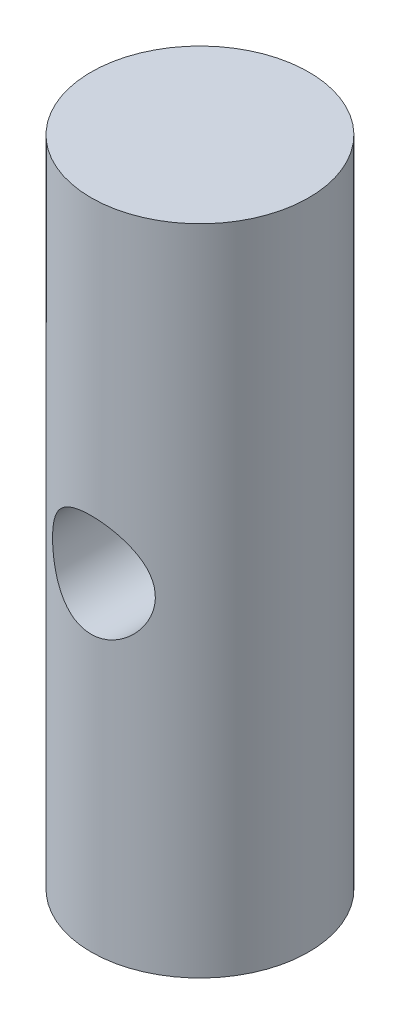
ISO-10303-21;
HEADER;
FILE_DESCRIPTION(('STEP AP214'),'2;1');
FILE_NAME('part.step','',(''),(''),'','','');
FILE_SCHEMA(('AUTOMOTIVE_DESIGN { 1 0 10303 214 1 1 1 1 }'));
ENDSEC;
DATA;
#1=APPLICATION_CONTEXT('core data for automotive mechanical design processes');
#2=APPLICATION_PROTOCOL_DEFINITION('international standard','automotive_design',2000,#1);
#3=PRODUCT_CONTEXT('',#1,'mechanical');
#4=PRODUCT('Part','Part','',(#3));
#5=PRODUCT_RELATED_PRODUCT_CATEGORY('part','',(#4));
#6=PRODUCT_DEFINITION_FORMATION('','',#4);
#7=PRODUCT_DEFINITION_CONTEXT('part definition',#1,'design');
#8=PRODUCT_DEFINITION('design','',#6,#7);
#9=PRODUCT_DEFINITION_SHAPE('','',#8);
#10=(LENGTH_UNIT() NAMED_UNIT(*) SI_UNIT(.MILLI.,.METRE.));
#11=(NAMED_UNIT(*) PLANE_ANGLE_UNIT() SI_UNIT($,.RADIAN.));
#12=(NAMED_UNIT(*) SI_UNIT($,.STERADIAN.) SOLID_ANGLE_UNIT());
#13=UNCERTAINTY_MEASURE_WITH_UNIT(LENGTH_MEASURE(1.E-05),#10,'distance_accuracy_value','');
#14=(GEOMETRIC_REPRESENTATION_CONTEXT(3) GLOBAL_UNCERTAINTY_ASSIGNED_CONTEXT((#13)) GLOBAL_UNIT_ASSIGNED_CONTEXT((#10,
#11,#12)) REPRESENTATION_CONTEXT('',''));
#15=CARTESIAN_POINT('',(0.,0.,0.));
#16=DIRECTION('',(0.,0.,1.));
#17=DIRECTION('',(1.,0.,0.));
#18=AXIS2_PLACEMENT_3D('',#15,#16,#17);
#19=CARTESIAN_POINT('',(0.,19.05,0.));
#20=DIRECTION('',(0.,-1.,0.));
#21=DIRECTION('',(0.,0.,-1.));
#22=AXIS2_PLACEMENT_3D('',#19,#20,#21);
#23=CYLINDRICAL_SURFACE('',#22,3.175);
#24=CARTESIAN_POINT('',(0.,19.05,0.));
#25=DIRECTION('',(0.,1.,0.));
#26=DIRECTION('',(0.,0.,1.));
#27=AXIS2_PLACEMENT_3D('',#24,#25,#26);
#28=CIRCLE('',#27,3.175);
#29=CARTESIAN_POINT('',(0.,19.05,3.175));
#30=VERTEX_POINT('',#29);
#31=EDGE_CURVE('E10',#30,#30,#28,.T.);
#32=ORIENTED_EDGE('',*,*,#31,.F.);
#33=EDGE_LOOP('',(#32));
#34=FACE_BOUND('',#33,.T.);
#35=CARTESIAN_POINT('',(0.,0.,0.));
#36=DIRECTION('',(0.,1.,0.));
#37=DIRECTION('',(0.,0.,1.));
#38=AXIS2_PLACEMENT_3D('',#35,#36,#37);
#39=CIRCLE('',#38,3.175);
#40=CARTESIAN_POINT('',(0.,0.,3.175));
#41=VERTEX_POINT('',#40);
#42=EDGE_CURVE('E46',#41,#41,#39,.T.);
#43=ORIENTED_EDGE('',*,*,#42,.T.);
#44=EDGE_LOOP('',(#43));
#45=FACE_BOUND('',#44,.T.);
#46=CARTESIAN_POINT('',(-1.4986,9.52500000000001,2.79907539019584));
#47=CARTESIAN_POINT('',(-1.49859525274599,9.44625277110889,2.79908094864217));
#48=CARTESIAN_POINT('',(-1.49235258129164,9.36739129426081,2.80244790388345));
#49=CARTESIAN_POINT('',(-1.46767606579195,9.21203633017721,2.81544586122155));
#50=CARTESIAN_POINT('',(-1.44921381278011,9.13554879690695,2.82509145949614));
#51=CARTESIAN_POINT('',(-1.40103604915084,8.98747563410045,2.84928743266656));
#52=CARTESIAN_POINT('',(-1.37137530680752,8.91586811844375,2.86381389931857));
#53=CARTESIAN_POINT('',(-1.30180847915593,8.77866285343059,2.89609829288426));
#54=CARTESIAN_POINT('',(-1.26190284575299,8.71306483916629,2.91385607725346));
#55=CARTESIAN_POINT('',(-1.16955327149753,8.58443409527947,2.95219309581897));
#56=CARTESIAN_POINT('',(-1.11640618581606,8.52193911852819,2.97288368175924));
#57=CARTESIAN_POINT('',(-1.00054973494847,8.40633859230654,3.01385145765495));
#58=CARTESIAN_POINT('',(-0.937836044662146,8.35323731333441,3.03412845590108));
#59=CARTESIAN_POINT('',(-0.800137369823889,8.25490300420467,3.07340492554687));
#60=CARTESIAN_POINT('',(-0.724649268859258,8.21031161482117,3.09226036654976));
#61=CARTESIAN_POINT('',(-0.56618781225491,8.13470271361576,3.12515385877692));
#62=CARTESIAN_POINT('',(-0.483218709957832,8.10367754665184,3.13919462585548));
#63=CARTESIAN_POINT('',(-0.317830558279715,8.05814643825242,3.16007921690025));
#64=CARTESIAN_POINT('',(-0.235721985413614,8.04270311504359,3.16732924544885));
#65=CARTESIAN_POINT('',(-0.0697822347022773,8.02570754014559,3.1753174564992));
#66=CARTESIAN_POINT('',(0.0140480043131758,8.02414790917636,3.17605909825132));
#67=CARTESIAN_POINT('',(0.174087776839426,8.03455579740571,3.17115640390632));
#68=CARTESIAN_POINT('',(0.250383327211232,8.04548166194073,3.16600378599288));
#69=CARTESIAN_POINT('',(0.399907930100079,8.07871432532521,3.15061091504814));
#70=CARTESIAN_POINT('',(0.473136754258764,8.10102197007409,3.14037028387471));
#71=CARTESIAN_POINT('',(0.615786299683944,8.15658554520967,3.11556672617083));
#72=CARTESIAN_POINT('',(0.68513467728847,8.18999852701138,3.10094211065064));
#73=CARTESIAN_POINT('',(0.817417883828342,8.266636160278,3.068728529374));
#74=CARTESIAN_POINT('',(0.880350351471504,8.30986440536888,3.05113847850263));
#75=CARTESIAN_POINT('',(1.00382158329375,8.40922436294251,3.01288863718608));
#76=CARTESIAN_POINT('',(1.06368128759606,8.46614924111113,2.99209492528907));
#77=CARTESIAN_POINT('',(1.1733475361455,8.5891302551537,2.95081699198232));
#78=CARTESIAN_POINT('',(1.22314779220729,8.65519205934713,2.93033297151652));
#79=CARTESIAN_POINT('',(1.31377670034922,8.79880046459922,2.89088002508329));
#80=CARTESIAN_POINT('',(1.35400720124191,8.87676465146671,2.87204449206278));
#81=CARTESIAN_POINT('',(1.42048070416232,9.03946961733449,2.83976055028701));
#82=CARTESIAN_POINT('',(1.44673685115611,9.1242039413921,2.82630708186621));
#83=CARTESIAN_POINT('',(1.48253180169813,9.29125823583037,2.80768678220104));
#84=CARTESIAN_POINT('',(1.49318445361187,9.37327637849114,2.80197033310068));
#85=CARTESIAN_POINT('',(1.50080854106799,9.53810977771485,2.79789626719231));
#86=CARTESIAN_POINT('',(1.49778748920422,9.62092457162927,2.79953460951747));
#87=CARTESIAN_POINT('',(1.47917144640693,9.77689541124524,2.80940639461473));
#88=CARTESIAN_POINT('',(1.46476116948012,9.85023811984433,2.81701799135724));
#89=CARTESIAN_POINT('',(1.42546667776212,9.99335549949877,2.83710289468067));
#90=CARTESIAN_POINT('',(1.40057948030016,10.0631291481308,2.84957758565928));
#91=CARTESIAN_POINT('',(1.33980056686622,10.2007641070234,2.87866987495457));
#92=CARTESIAN_POINT('',(1.30345387528841,10.2683884399627,2.89545214161437));
#93=CARTESIAN_POINT('',(1.22120131799166,10.3969517720908,2.93109195876434));
#94=CARTESIAN_POINT('',(1.17529068733348,10.4578874156501,2.94995054149873));
#95=CARTESIAN_POINT('',(1.06930681982516,10.5783298374194,2.99010969292066));
#96=CARTESIAN_POINT('',(1.0082322167936,10.6369457639801,3.01145110987416));
#97=CARTESIAN_POINT('',(0.876708405967097,10.7433346244367,3.05233474132195));
#98=CARTESIAN_POINT('',(0.806257063986819,10.7911050831408,3.07187654449827));
#99=CARTESIAN_POINT('',(0.656287074705175,10.8750321884116,3.10740059139785));
#100=CARTESIAN_POINT('',(0.576639126091686,10.9109864047612,3.12331948428914));
#101=CARTESIAN_POINT('',(0.411461828055365,10.968653919878,3.14933199170356));
#102=CARTESIAN_POINT('',(0.325937128529462,10.9903783376255,3.15943015372821));
#103=CARTESIAN_POINT('',(0.15927231504107,11.0172955612106,3.17200928451669));
#104=CARTESIAN_POINT('',(0.0783760789037101,11.0237348881232,3.17506397094591));
#105=CARTESIAN_POINT('',(-0.0833782246436938,11.023460938205,3.17493405916658));
#106=CARTESIAN_POINT('',(-0.164236296412011,11.0167513185504,3.17175119583609));
#107=CARTESIAN_POINT('',(-0.319014217129011,10.9912370611442,3.15983521518638));
#108=CARTESIAN_POINT('',(-0.393072165471257,10.9731106053602,3.15141361496967));
#109=CARTESIAN_POINT('',(-0.53700850120879,10.9261275023595,3.13010291808734));
#110=CARTESIAN_POINT('',(-0.606886220283878,10.8972691446585,3.11721310928681));
#111=CARTESIAN_POINT('',(-0.743989739416267,10.828240830979,3.08743385726438));
#112=CARTESIAN_POINT('',(-0.810953832002758,10.7876194454467,3.07039025678518));
#113=CARTESIAN_POINT('',(-0.937406909874934,10.6968091449144,3.03417645376589));
#114=CARTESIAN_POINT('',(-0.99689248268869,10.646615888342,3.01500528786889));
#115=CARTESIAN_POINT('',(-1.11227736778022,10.5328578234679,2.97447964914297));
#116=CARTESIAN_POINT('',(-1.167381652465,10.4684990749229,2.95308312285794));
#117=CARTESIAN_POINT('',(-1.26624024626413,10.3309843613105,2.91206687229312));
#118=CARTESIAN_POINT('',(-1.30998623967189,10.2578220079174,2.89244845661693));
#119=CARTESIAN_POINT('',(-1.3853450865656,10.1030550922854,2.85713324181512));
#120=CARTESIAN_POINT('',(-1.41675199249769,10.021333905698,2.84150441874722));
#121=CARTESIAN_POINT('',(-1.46489737928608,9.85286572654011,2.81699332772927));
#122=CARTESIAN_POINT('',(-1.48168510423179,9.76613666392309,2.80808842412327));
#123=CARTESIAN_POINT('',(-1.49334048585071,9.65305495443223,2.80188538723777));
#124=CARTESIAN_POINT('',(-1.49531039439653,9.62749932274479,2.80083449125149));
#125=CARTESIAN_POINT('',(-1.49794095785027,9.57629983931403,2.79942856969011));
#126=CARTESIAN_POINT('',(-1.49860154666356,9.55065598318256,2.79907357924442));
#127=CARTESIAN_POINT('',(-1.4986,9.52500000000001,2.79907539019584));
#128=B_SPLINE_CURVE_WITH_KNOTS('',3,(#46,#47,#48,#49,#50,#51,#52,#53,#54,#55,#56,#57,#58,#59,
#60,#61,#62,#63,#64,#65,#66,#67,#68,#69,#70,#71,#72,#73,#74,#75,#76,#77,#78,#79,#80,#81,#82,#83,
#84,#85,#86,#87,#88,#89,#90,#91,#92,#93,#94,#95,#96,#97,#98,#99,#100,#101,#102,#103,#104,#105,
#106,#107,#108,#109,#110,#111,#112,#113,#114,#115,#116,#117,#118,#119,#120,#121,#122,#123,#124,
#125,#126,#127),.UNSPECIFIED.,.T.,.F.,(4,2,2,2,2,2,2,2,2,2,2,2,2,2,2,2,2,2,2,2,2,2,2,2,2,2,2,2,
2,2,2,2,2,2,2,2,2,2,2,2,4),(0.,0.236133855681634,0.472818629880157,0.708360540938056,
0.943892063953606,1.19663513462454,1.44949281197332,1.71713588150534,1.98462773001415,
2.23484574557438,2.48493076055394,2.71558396204307,2.94625430828758,3.18033640204269,
3.41450433799933,3.6689476823109,3.92354959088569,4.19133620371269,4.45887047606113,
4.70617746721847,4.95334859969336,5.17773591195215,5.40218714820099,5.63699996396635,
5.87193004901366,6.13264466369259,6.39341871991878,6.6584519641035,6.9232778669094,
7.16562877166453,7.40791227982724,7.63700882471084,7.86614189938369,8.10560820899476,
8.34518339426639,8.6061595115457,8.86732616101113,9.13268340814802,9.39714331426018,
9.47407224899997,9.55100506702429),.UNSPECIFIED.);
#129=CARTESIAN_POINT('',(-1.4986,9.52500000000001,2.79907539019584));
#130=VERTEX_POINT('',#129);
#131=EDGE_CURVE('E38',#130,#130,#128,.T.);
#132=ORIENTED_EDGE('',*,*,#131,.F.);
#133=EDGE_LOOP('',(#132));
#134=FACE_BOUND('',#133,.T.);
#135=CARTESIAN_POINT('',(1.4986,9.52500000000001,-2.79907539019584));
#136=CARTESIAN_POINT('',(1.49859525274599,9.44625277110889,-2.79908094864217));
#137=CARTESIAN_POINT('',(1.49235258129164,9.36739129426081,-2.80244790388345));
#138=CARTESIAN_POINT('',(1.46767606579195,9.21203633017721,-2.81544586122155));
#139=CARTESIAN_POINT('',(1.44921381278011,9.13554879690695,-2.82509145949614));
#140=CARTESIAN_POINT('',(1.40103604915084,8.98747563410045,-2.84928743266656));
#141=CARTESIAN_POINT('',(1.37137530680752,8.91586811844375,-2.86381389931857));
#142=CARTESIAN_POINT('',(1.30180847915593,8.77866285343059,-2.89609829288426));
#143=CARTESIAN_POINT('',(1.26190284575299,8.71306483916629,-2.91385607725345));
#144=CARTESIAN_POINT('',(1.16955327149754,8.58443409527947,-2.95219309581897));
#145=CARTESIAN_POINT('',(1.11640618581606,8.5219391185282,-2.97288368175924));
#146=CARTESIAN_POINT('',(1.00054973494847,8.40633859230654,-3.01385145765495));
#147=CARTESIAN_POINT('',(0.937836044662148,8.35323731333441,-3.03412845590108));
#148=CARTESIAN_POINT('',(0.800137369823892,8.25490300420467,-3.07340492554687));
#149=CARTESIAN_POINT('',(0.724649268859261,8.21031161482117,-3.09226036654976));
#150=CARTESIAN_POINT('',(0.566187812254912,8.13470271361576,-3.12515385877692));
#151=CARTESIAN_POINT('',(0.483218709957834,8.10367754665184,-3.13919462585548));
#152=CARTESIAN_POINT('',(0.317830558279716,8.05814643825242,-3.16007921690025));
#153=CARTESIAN_POINT('',(0.235721985413616,8.04270311504359,-3.16732924544885));
#154=CARTESIAN_POINT('',(0.0697822347022784,8.02570754014559,-3.1753174564992));
#155=CARTESIAN_POINT('',(-0.014048004313175,8.02414790917636,-3.17605909825132));
#156=CARTESIAN_POINT('',(-0.174087776839426,8.03455579740571,-3.17115640390632));
#157=CARTESIAN_POINT('',(-0.250383327211232,8.04548166194073,-3.16600378599288));
#158=CARTESIAN_POINT('',(-0.399907930100079,8.07871432532521,-3.15061091504814));
#159=CARTESIAN_POINT('',(-0.473136754258764,8.10102197007409,-3.14037028387471));
#160=CARTESIAN_POINT('',(-0.615786299683945,8.15658554520968,-3.11556672617083));
#161=CARTESIAN_POINT('',(-0.685134677288472,8.18999852701138,-3.10094211065064));
#162=CARTESIAN_POINT('',(-0.817417883828343,8.266636160278,-3.068728529374));
#163=CARTESIAN_POINT('',(-0.880350351471505,8.30986440536888,-3.05113847850263));
#164=CARTESIAN_POINT('',(-1.00382158329375,8.40922436294251,-3.01288863718608));
#165=CARTESIAN_POINT('',(-1.06368128759606,8.46614924111113,-2.99209492528907));
#166=CARTESIAN_POINT('',(-1.1733475361455,8.5891302551537,-2.95081699198232));
#167=CARTESIAN_POINT('',(-1.22314779220729,8.65519205934713,-2.93033297151652));
#168=CARTESIAN_POINT('',(-1.31377670034922,8.79880046459922,-2.89088002508329));
#169=CARTESIAN_POINT('',(-1.35400720124191,8.87676465146671,-2.87204449206278));
#170=CARTESIAN_POINT('',(-1.42048070416233,9.03946961733449,-2.83976055028701));
#171=CARTESIAN_POINT('',(-1.44673685115611,9.1242039413921,-2.82630708186621));
#172=CARTESIAN_POINT('',(-1.48253180169813,9.29125823583037,-2.80768678220103));
#173=CARTESIAN_POINT('',(-1.49318445361187,9.37327637849114,-2.80197033310068));
#174=CARTESIAN_POINT('',(-1.50080854106799,9.53810977771485,-2.79789626719231));
#175=CARTESIAN_POINT('',(-1.49778748920422,9.62092457162927,-2.79953460951747));
#176=CARTESIAN_POINT('',(-1.47917144640693,9.77689541124524,-2.80940639461473));
#177=CARTESIAN_POINT('',(-1.46476116948012,9.85023811984433,-2.81701799135724));
#178=CARTESIAN_POINT('',(-1.42546667776212,9.99335549949877,-2.83710289468067));
#179=CARTESIAN_POINT('',(-1.40057948030016,10.0631291481308,-2.84957758565928));
#180=CARTESIAN_POINT('',(-1.33980056686622,10.2007641070234,-2.87866987495457));
#181=CARTESIAN_POINT('',(-1.30345387528841,10.2683884399627,-2.89545214161437));
#182=CARTESIAN_POINT('',(-1.22120131799166,10.3969517720908,-2.93109195876434));
#183=CARTESIAN_POINT('',(-1.17529068733348,10.4578874156501,-2.94995054149873));
#184=CARTESIAN_POINT('',(-1.06930681982516,10.5783298374194,-2.99010969292065));
#185=CARTESIAN_POINT('',(-1.0082322167936,10.6369457639801,-3.01145110987416));
#186=CARTESIAN_POINT('',(-0.876708405967099,10.7433346244367,-3.05233474132195));
#187=CARTESIAN_POINT('',(-0.806257063986821,10.7911050831408,-3.07187654449827));
#188=CARTESIAN_POINT('',(-0.656287074705176,10.8750321884116,-3.10740059139785));
#189=CARTESIAN_POINT('',(-0.576639126091688,10.9109864047612,-3.12331948428913));
#190=CARTESIAN_POINT('',(-0.411461828055367,10.968653919878,-3.14933199170356));
#191=CARTESIAN_POINT('',(-0.325937128529464,10.9903783376255,-3.15943015372821));
#192=CARTESIAN_POINT('',(-0.159272315041072,11.0172955612106,-3.17200928451669));
#193=CARTESIAN_POINT('',(-0.0783760789037116,11.0237348881232,-3.17506397094591));
#194=CARTESIAN_POINT('',(0.0833782246436925,11.023460938205,-3.17493405916658));
#195=CARTESIAN_POINT('',(0.16423629641201,11.0167513185504,-3.17175119583609));
#196=CARTESIAN_POINT('',(0.31901421712901,10.9912370611442,-3.15983521518638));
#197=CARTESIAN_POINT('',(0.393072165471257,10.9731106053602,-3.15141361496967));
#198=CARTESIAN_POINT('',(0.53700850120879,10.9261275023595,-3.13010291808734));
#199=CARTESIAN_POINT('',(0.606886220283878,10.8972691446585,-3.11721310928681));
#200=CARTESIAN_POINT('',(0.743989739416266,10.828240830979,-3.08743385726438));
#201=CARTESIAN_POINT('',(0.810953832002758,10.7876194454467,-3.07039025678518));
#202=CARTESIAN_POINT('',(0.937406909874934,10.6968091449144,-3.03417645376589));
#203=CARTESIAN_POINT('',(0.99689248268869,10.646615888342,-3.01500528786889));
#204=CARTESIAN_POINT('',(1.11227736778022,10.5328578234679,-2.97447964914297));
#205=CARTESIAN_POINT('',(1.167381652465,10.4684990749229,-2.95308312285794));
#206=CARTESIAN_POINT('',(1.26624024626413,10.3309843613105,-2.91206687229311));
#207=CARTESIAN_POINT('',(1.30998623967189,10.2578220079174,-2.89244845661693));
#208=CARTESIAN_POINT('',(1.3853450865656,10.1030550922854,-2.85713324181512));
#209=CARTESIAN_POINT('',(1.41675199249769,10.021333905698,-2.84150441874722));
#210=CARTESIAN_POINT('',(1.46489737928608,9.8528657265401,-2.81699332772927));
#211=CARTESIAN_POINT('',(1.48168510423179,9.76613666392309,-2.80808842412327));
#212=CARTESIAN_POINT('',(1.49334048585071,9.65305495443222,-2.80188538723777));
#213=CARTESIAN_POINT('',(1.49531039439653,9.62749932274479,-2.80083449125149));
#214=CARTESIAN_POINT('',(1.49794095785027,9.57629983931403,-2.79942856969011));
#215=CARTESIAN_POINT('',(1.49860154666356,9.55065598318256,-2.79907357924442));
#216=CARTESIAN_POINT('',(1.4986,9.52500000000001,-2.79907539019584));
#217=B_SPLINE_CURVE_WITH_KNOTS('',3,(#135,#136,#137,#138,#139,#140,#141,#142,#143,#144,#145,
#146,#147,#148,#149,#150,#151,#152,#153,#154,#155,#156,#157,#158,#159,#160,#161,#162,#163,#164,
#165,#166,#167,#168,#169,#170,#171,#172,#173,#174,#175,#176,#177,#178,#179,#180,#181,#182,#183,
#184,#185,#186,#187,#188,#189,#190,#191,#192,#193,#194,#195,#196,#197,#198,#199,#200,#201,#202,
#203,#204,#205,#206,#207,#208,#209,#210,#211,#212,#213,#214,#215,#216),.UNSPECIFIED.,.T.,.F.,(4,
2,2,2,2,2,2,2,2,2,2,2,2,2,2,2,2,2,2,2,2,2,2,2,2,2,2,2,2,2,2,2,2,2,2,2,2,2,2,2,4),(0.,
0.236133855681634,0.472818629880157,0.708360540938056,0.943892063953604,1.19663513462454,
1.44949281197331,1.71713588150534,1.98462773001415,2.23484574557438,2.48493076055394,
2.71558396204307,2.94625430828758,3.18033640204269,3.41450433799933,3.6689476823109,
3.92354959088569,4.19133620371269,4.45887047606113,4.70617746721847,4.95334859969336,
5.17773591195215,5.40218714820099,5.63699996396634,5.87193004901366,6.13264466369259,
6.39341871991878,6.6584519641035,6.92327786690939,7.16562877166452,7.40791227982724,
7.63700882471084,7.86614189938369,8.10560820899476,8.34518339426639,8.6061595115457,
8.86732616101113,9.13268340814802,9.39714331426018,9.47407224899997,9.55100506702429),.UNSPECIFIED.);
#218=CARTESIAN_POINT('',(1.4986,9.52500000000001,-2.79907539019584));
#219=VERTEX_POINT('',#218);
#220=EDGE_CURVE('E52',#219,#219,#217,.T.);
#221=ORIENTED_EDGE('',*,*,#220,.F.);
#222=EDGE_LOOP('',(#221));
#223=FACE_BOUND('',#222,.T.);
#224=ADVANCED_FACE('F34',(#34,#45,#134,#223),#23,.T.);
#225=CARTESIAN_POINT('',(0.,19.05,0.));
#226=DIRECTION('',(0.,1.,0.));
#227=DIRECTION('',(0.,0.,1.));
#228=AXIS2_PLACEMENT_3D('',#225,#226,#227);
#229=PLANE('',#228);
#230=ORIENTED_EDGE('',*,*,#31,.T.);
#231=EDGE_LOOP('',(#230));
#232=FACE_BOUND('',#231,.T.);
#233=ADVANCED_FACE('F67',(#232),#229,.T.);
#234=CARTESIAN_POINT('',(0.,0.,0.));
#235=DIRECTION('',(0.,1.,0.));
#236=DIRECTION('',(0.,0.,1.));
#237=AXIS2_PLACEMENT_3D('',#234,#235,#236);
#238=PLANE('',#237);
#239=ORIENTED_EDGE('',*,*,#42,.F.);
#240=EDGE_LOOP('',(#239));
#241=FACE_BOUND('',#240,.T.);
#242=ADVANCED_FACE('F65',(#241),#238,.F.);
#243=CARTESIAN_POINT('',(0.,9.52500000000001,19.05));
#244=DIRECTION('',(0.,0.,-1.));
#245=DIRECTION('',(-1.,0.,0.));
#246=AXIS2_PLACEMENT_3D('',#243,#244,#245);
#247=CYLINDRICAL_SURFACE('',#246,1.4986);
#248=ORIENTED_EDGE('',*,*,#220,.T.);
#249=EDGE_LOOP('',(#248));
#250=FACE_BOUND('',#249,.T.);
#251=ORIENTED_EDGE('',*,*,#131,.T.);
#252=EDGE_LOOP('',(#251));
#253=FACE_BOUND('',#252,.T.);
#254=ADVANCED_FACE('F61',(#250,#253),#247,.F.);
#255=CLOSED_SHELL('',(#224,#233,#242,#254));
#256=MANIFOLD_SOLID_BREP('B2',#255);
#257=ADVANCED_BREP_SHAPE_REPRESENTATION('',(#18,#256),#14);
#258=SHAPE_DEFINITION_REPRESENTATION(#9,#257);
ENDSEC;
END-ISO-10303-21;
